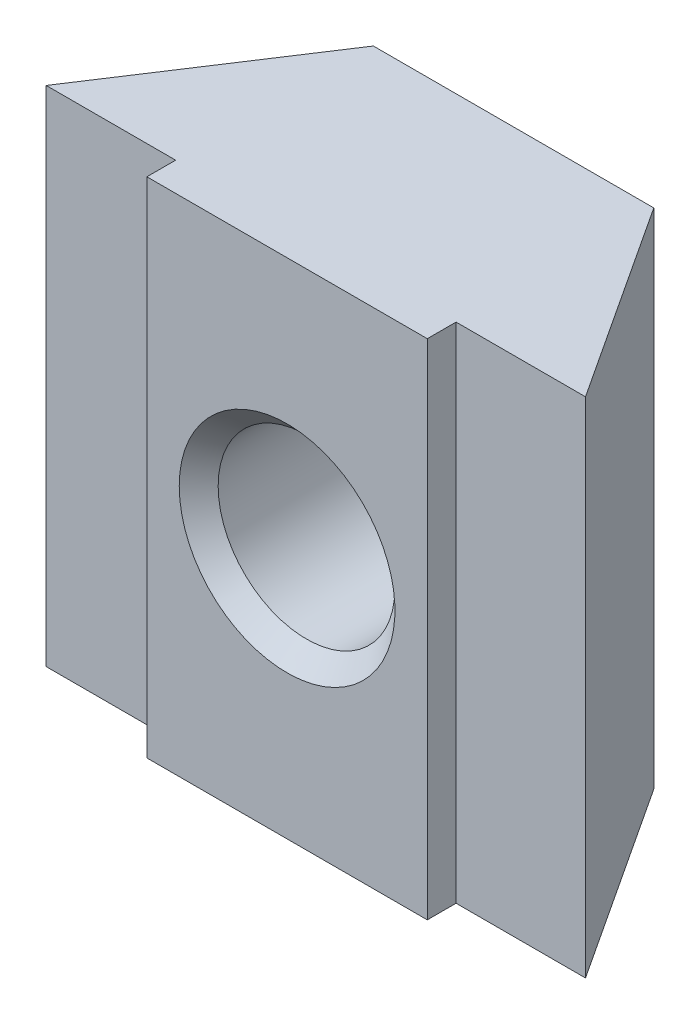
ISO-10303-21;
HEADER;
FILE_DESCRIPTION(('STEP AP214'),'2;1');
FILE_NAME('part.step','',(''),(''),'','','');
FILE_SCHEMA(('AUTOMOTIVE_DESIGN { 1 0 10303 214 1 1 1 1 }'));
ENDSEC;
DATA;
#1=APPLICATION_CONTEXT('core data for automotive mechanical design processes');
#2=APPLICATION_PROTOCOL_DEFINITION('international standard','automotive_design',2000,#1);
#3=PRODUCT_CONTEXT('',#1,'mechanical');
#4=PRODUCT('Part','Part','',(#3));
#5=PRODUCT_RELATED_PRODUCT_CATEGORY('part','',(#4));
#6=PRODUCT_DEFINITION_FORMATION('','',#4);
#7=PRODUCT_DEFINITION_CONTEXT('part definition',#1,'design');
#8=PRODUCT_DEFINITION('design','',#6,#7);
#9=PRODUCT_DEFINITION_SHAPE('','',#8);
#10=(LENGTH_UNIT() NAMED_UNIT(*) SI_UNIT(.MILLI.,.METRE.));
#11=(NAMED_UNIT(*) PLANE_ANGLE_UNIT() SI_UNIT($,.RADIAN.));
#12=(NAMED_UNIT(*) SI_UNIT($,.STERADIAN.) SOLID_ANGLE_UNIT());
#13=UNCERTAINTY_MEASURE_WITH_UNIT(LENGTH_MEASURE(1.E-05),#10,'distance_accuracy_value','');
#14=(GEOMETRIC_REPRESENTATION_CONTEXT(3) GLOBAL_UNCERTAINTY_ASSIGNED_CONTEXT((#13)) GLOBAL_UNIT_ASSIGNED_CONTEXT((#10,
#11,#12)) REPRESENTATION_CONTEXT('',''));
#15=CARTESIAN_POINT('',(0.,0.,0.));
#16=DIRECTION('',(0.,0.,1.));
#17=DIRECTION('',(1.,0.,0.));
#18=AXIS2_PLACEMENT_3D('',#15,#16,#17);
#19=CARTESIAN_POINT('',(8.,14.5,-10.1));
#20=DIRECTION('',(0.,0.,1.));
#21=DIRECTION('',(1.,0.,0.));
#22=AXIS2_PLACEMENT_3D('',#19,#20,#21);
#23=PLANE('',#22);
#24=DIRECTION('',(0.,1.,0.));
#25=VECTOR('',#24,1.);
#26=CARTESIAN_POINT('',(19.4,28.5,-10.1));
#27=LINE('',#26,#25);
#28=CARTESIAN_POINT('',(19.4,14.5,-10.1));
#29=VERTEX_POINT('',#28);
#30=CARTESIAN_POINT('',(19.4,28.5,-10.1));
#31=VERTEX_POINT('',#30);
#32=EDGE_CURVE('E50',#29,#31,#27,.T.);
#33=ORIENTED_EDGE('',*,*,#32,.F.);
#34=DIRECTION('',(1.,0.,0.));
#35=VECTOR('',#34,1.);
#36=CARTESIAN_POINT('',(8.,14.5,-10.1));
#37=LINE('',#36,#35);
#38=CARTESIAN_POINT('',(23.,14.5,-10.1));
#39=VERTEX_POINT('',#38);
#40=EDGE_CURVE('E149',#29,#39,#37,.T.);
#41=ORIENTED_EDGE('',*,*,#40,.T.);
#42=DIRECTION('',(0.,1.,0.));
#43=VECTOR('',#42,1.);
#44=CARTESIAN_POINT('',(23.,14.5,-10.1));
#45=LINE('',#44,#43);
#46=CARTESIAN_POINT('',(23.,28.5,-10.1));
#47=VERTEX_POINT('',#46);
#48=EDGE_CURVE('E190',#39,#47,#45,.T.);
#49=ORIENTED_EDGE('',*,*,#48,.T.);
#50=DIRECTION('',(1.,0.,0.));
#51=VECTOR('',#50,1.);
#52=CARTESIAN_POINT('',(8.,28.5,-10.1));
#53=LINE('',#52,#51);
#54=EDGE_CURVE('E55',#31,#47,#53,.T.);
#55=ORIENTED_EDGE('',*,*,#54,.F.);
#56=EDGE_LOOP('',(#33,#41,#49,#55));
#57=FACE_BOUND('',#56,.T.);
#58=ADVANCED_FACE('F35',(#57),#23,.T.);
#59=CARTESIAN_POINT('',(19.4,14.5,-15.6));
#60=DIRECTION('',(0.,0.,-1.));
#61=DIRECTION('',(-1.,0.,0.));
#62=AXIS2_PLACEMENT_3D('',#59,#60,#61);
#63=PLANE('',#62);
#64=CARTESIAN_POINT('',(15.5,21.5,-15.6));
#65=DIRECTION('',(0.,0.,-1.));
#66=DIRECTION('',(-1.,0.,0.));
#67=AXIS2_PLACEMENT_3D('',#64,#65,#66);
#68=CIRCLE('',#67,3.00000000000765);
#69=CARTESIAN_POINT('',(12.4999999999923,21.5,-15.6));
#70=VERTEX_POINT('',#69);
#71=EDGE_CURVE('E189',#70,#70,#68,.F.);
#72=ORIENTED_EDGE('',*,*,#71,.T.);
#73=EDGE_LOOP('',(#72));
#74=FACE_BOUND('',#73,.T.);
#75=DIRECTION('',(-1.,0.,0.));
#76=VECTOR('',#75,1.);
#77=CARTESIAN_POINT('',(19.4,28.5,-15.6));
#78=LINE('',#77,#76);
#79=CARTESIAN_POINT('',(19.4,28.5,-15.6));
#80=VERTEX_POINT('',#79);
#81=CARTESIAN_POINT('',(11.6,28.5,-15.6));
#82=VERTEX_POINT('',#81);
#83=EDGE_CURVE('E122',#80,#82,#78,.T.);
#84=ORIENTED_EDGE('',*,*,#83,.F.);
#85=DIRECTION('',(0.,1.,0.));
#86=VECTOR('',#85,1.);
#87=CARTESIAN_POINT('',(19.4,14.5,-15.6));
#88=LINE('',#87,#86);
#89=CARTESIAN_POINT('',(19.4,14.5,-15.6));
#90=VERTEX_POINT('',#89);
#91=EDGE_CURVE('E187',#90,#80,#88,.T.);
#92=ORIENTED_EDGE('',*,*,#91,.F.);
#93=DIRECTION('',(-1.,0.,0.));
#94=VECTOR('',#93,1.);
#95=CARTESIAN_POINT('',(19.4,14.5,-15.6));
#96=LINE('',#95,#94);
#97=CARTESIAN_POINT('',(11.6,14.5,-15.6));
#98=VERTEX_POINT('',#97);
#99=EDGE_CURVE('E143',#90,#98,#96,.T.);
#100=ORIENTED_EDGE('',*,*,#99,.T.);
#101=DIRECTION('',(0.,1.,0.));
#102=VECTOR('',#101,1.);
#103=CARTESIAN_POINT('',(11.6,14.5,-15.6));
#104=LINE('',#103,#102);
#105=EDGE_CURVE('E193',#98,#82,#104,.T.);
#106=ORIENTED_EDGE('',*,*,#105,.T.);
#107=EDGE_LOOP('',(#84,#92,#100,#106));
#108=FACE_BOUND('',#107,.T.);
#109=ADVANCED_FACE('F201',(#74,#108),#63,.T.);
#110=CARTESIAN_POINT('',(23.,14.5,-10.1));
#111=DIRECTION('',(0.836701516894204,0.,-0.547659174694388));
#112=DIRECTION('',(-0.547659174694388,0.,-0.836701516894204));
#113=AXIS2_PLACEMENT_3D('',#110,#111,#112);
#114=PLANE('',#113);
#115=DIRECTION('',(-0.547659174694388,0.,-0.836701516894204));
#116=VECTOR('',#115,1.);
#117=CARTESIAN_POINT('',(23.,28.5,-10.1));
#118=LINE('',#117,#116);
#119=EDGE_CURVE('E172',#47,#80,#118,.T.);
#120=ORIENTED_EDGE('',*,*,#119,.F.);
#121=ORIENTED_EDGE('',*,*,#48,.F.);
#122=DIRECTION('',(-0.547659174694388,0.,-0.836701516894204));
#123=VECTOR('',#122,1.);
#124=CARTESIAN_POINT('',(23.,14.5,-10.1));
#125=LINE('',#124,#123);
#126=EDGE_CURVE('E164',#39,#90,#125,.T.);
#127=ORIENTED_EDGE('',*,*,#126,.T.);
#128=ORIENTED_EDGE('',*,*,#91,.T.);
#129=EDGE_LOOP('',(#120,#121,#127,#128));
#130=FACE_BOUND('',#129,.T.);
#131=ADVANCED_FACE('F199',(#130),#114,.T.);
#132=DIRECTION('',(0.,-1.,0.));
#133=VECTOR('',#132,1.);
#134=CARTESIAN_POINT('',(11.6,14.5,-10.1));
#135=LINE('',#134,#133);
#136=CARTESIAN_POINT('',(11.6,28.5,-10.1));
#137=VERTEX_POINT('',#136);
#138=CARTESIAN_POINT('',(11.6,14.5,-10.1));
#139=VERTEX_POINT('',#138);
#140=EDGE_CURVE('E119',#137,#139,#135,.T.);
#141=ORIENTED_EDGE('',*,*,#140,.F.);
#142=CARTESIAN_POINT('',(8.,28.5,-10.1));
#143=VERTEX_POINT('',#142);
#144=EDGE_CURVE('E179',#143,#137,#53,.T.);
#145=ORIENTED_EDGE('',*,*,#144,.F.);
#146=DIRECTION('',(0.,1.,0.));
#147=VECTOR('',#146,1.);
#148=CARTESIAN_POINT('',(8.,14.5,-10.1));
#149=LINE('',#148,#147);
#150=CARTESIAN_POINT('',(8.,14.5,-10.1));
#151=VERTEX_POINT('',#150);
#152=EDGE_CURVE('E192',#151,#143,#149,.T.);
#153=ORIENTED_EDGE('',*,*,#152,.F.);
#154=EDGE_CURVE('E166',#151,#139,#37,.T.);
#155=ORIENTED_EDGE('',*,*,#154,.T.);
#156=EDGE_LOOP('',(#141,#145,#153,#155));
#157=FACE_BOUND('',#156,.T.);
#158=ADVANCED_FACE('F203',(#157),#23,.T.);
#159=CARTESIAN_POINT('',(11.6,14.5,-15.6));
#160=DIRECTION('',(-0.836701516894204,0.,-0.547659174694388));
#161=DIRECTION('',(-0.547659174694388,0.,0.836701516894204));
#162=AXIS2_PLACEMENT_3D('',#159,#160,#161);
#163=PLANE('',#162);
#164=DIRECTION('',(-0.547659174694388,0.,0.836701516894204));
#165=VECTOR('',#164,1.);
#166=CARTESIAN_POINT('',(11.6,28.5,-15.6));
#167=LINE('',#166,#165);
#168=EDGE_CURVE('E124',#82,#143,#167,.T.);
#169=ORIENTED_EDGE('',*,*,#168,.F.);
#170=ORIENTED_EDGE('',*,*,#105,.F.);
#171=DIRECTION('',(-0.547659174694388,0.,0.836701516894204));
#172=VECTOR('',#171,1.);
#173=CARTESIAN_POINT('',(11.6,14.5,-15.6));
#174=LINE('',#173,#172);
#175=EDGE_CURVE('E167',#98,#151,#174,.T.);
#176=ORIENTED_EDGE('',*,*,#175,.T.);
#177=ORIENTED_EDGE('',*,*,#152,.T.);
#178=EDGE_LOOP('',(#169,#170,#176,#177));
#179=FACE_BOUND('',#178,.T.);
#180=ADVANCED_FACE('F212',(#179),#163,.T.);
#181=CARTESIAN_POINT('',(0.,14.5,0.));
#182=DIRECTION('',(0.,1.,0.));
#183=DIRECTION('',(0.,0.,1.));
#184=AXIS2_PLACEMENT_3D('',#181,#182,#183);
#185=PLANE('',#184);
#186=ORIENTED_EDGE('',*,*,#99,.F.);
#187=ORIENTED_EDGE('',*,*,#126,.F.);
#188=ORIENTED_EDGE('',*,*,#40,.F.);
#189=DIRECTION('',(0.,0.,-1.));
#190=VECTOR('',#189,1.);
#191=CARTESIAN_POINT('',(19.4,14.5,-9.3));
#192=LINE('',#191,#190);
#193=CARTESIAN_POINT('',(19.4,14.5,-9.3));
#194=VERTEX_POINT('',#193);
#195=EDGE_CURVE('E135',#194,#29,#192,.T.);
#196=ORIENTED_EDGE('',*,*,#195,.F.);
#197=DIRECTION('',(1.,0.,0.));
#198=VECTOR('',#197,1.);
#199=CARTESIAN_POINT('',(19.4,14.5,-9.3));
#200=LINE('',#199,#198);
#201=CARTESIAN_POINT('',(11.6,14.5,-9.3));
#202=VERTEX_POINT('',#201);
#203=EDGE_CURVE('E115',#202,#194,#200,.T.);
#204=ORIENTED_EDGE('',*,*,#203,.F.);
#205=DIRECTION('',(0.,0.,-1.));
#206=VECTOR('',#205,1.);
#207=CARTESIAN_POINT('',(11.6,14.5,-9.3));
#208=LINE('',#207,#206);
#209=EDGE_CURVE('E126',#202,#139,#208,.T.);
#210=ORIENTED_EDGE('',*,*,#209,.T.);
#211=ORIENTED_EDGE('',*,*,#154,.F.);
#212=ORIENTED_EDGE('',*,*,#175,.F.);
#213=EDGE_LOOP('',(#186,#187,#188,#196,#204,#210,#211,#212));
#214=FACE_BOUND('',#213,.T.);
#215=ADVANCED_FACE('F161',(#214),#185,.F.);
#216=CARTESIAN_POINT('',(0.,28.5,0.));
#217=DIRECTION('',(0.,1.,0.));
#218=DIRECTION('',(0.,0.,1.));
#219=AXIS2_PLACEMENT_3D('',#216,#217,#218);
#220=PLANE('',#219);
#221=ORIENTED_EDGE('',*,*,#83,.T.);
#222=ORIENTED_EDGE('',*,*,#168,.T.);
#223=ORIENTED_EDGE('',*,*,#144,.T.);
#224=DIRECTION('',(0.,0.,-1.));
#225=VECTOR('',#224,1.);
#226=CARTESIAN_POINT('',(11.6,28.5,-9.3));
#227=LINE('',#226,#225);
#228=CARTESIAN_POINT('',(11.6,28.5,-9.3));
#229=VERTEX_POINT('',#228);
#230=EDGE_CURVE('E106',#229,#137,#227,.T.);
#231=ORIENTED_EDGE('',*,*,#230,.F.);
#232=DIRECTION('',(-1.,0.,0.));
#233=VECTOR('',#232,1.);
#234=CARTESIAN_POINT('',(11.6,28.5,-9.3));
#235=LINE('',#234,#233);
#236=CARTESIAN_POINT('',(19.4,28.5,-9.3));
#237=VERTEX_POINT('',#236);
#238=EDGE_CURVE('E98',#237,#229,#235,.T.);
#239=ORIENTED_EDGE('',*,*,#238,.F.);
#240=DIRECTION('',(0.,0.,-1.));
#241=VECTOR('',#240,1.);
#242=CARTESIAN_POINT('',(19.4,28.5,-9.3));
#243=LINE('',#242,#241);
#244=EDGE_CURVE('E103',#237,#31,#243,.T.);
#245=ORIENTED_EDGE('',*,*,#244,.T.);
#246=ORIENTED_EDGE('',*,*,#54,.T.);
#247=ORIENTED_EDGE('',*,*,#119,.T.);
#248=EDGE_LOOP('',(#221,#222,#223,#231,#239,#245,#246,#247));
#249=FACE_BOUND('',#248,.T.);
#250=ADVANCED_FACE('F101',(#249),#220,.T.);
#251=CARTESIAN_POINT('',(19.4,28.5,-9.3));
#252=DIRECTION('',(-1.,0.,0.));
#253=DIRECTION('',(0.,0.,1.));
#254=AXIS2_PLACEMENT_3D('',#251,#252,#253);
#255=PLANE('',#254);
#256=ORIENTED_EDGE('',*,*,#32,.T.);
#257=ORIENTED_EDGE('',*,*,#244,.F.);
#258=DIRECTION('',(0.,1.,0.));
#259=VECTOR('',#258,1.);
#260=CARTESIAN_POINT('',(19.4,28.5,-9.3));
#261=LINE('',#260,#259);
#262=EDGE_CURVE('E110',#194,#237,#261,.T.);
#263=ORIENTED_EDGE('',*,*,#262,.F.);
#264=ORIENTED_EDGE('',*,*,#195,.T.);
#265=EDGE_LOOP('',(#256,#257,#263,#264));
#266=FACE_BOUND('',#265,.T.);
#267=ADVANCED_FACE('F121',(#266),#255,.F.);
#268=CARTESIAN_POINT('',(11.6,14.5,-9.3));
#269=DIRECTION('',(1.,0.,0.));
#270=DIRECTION('',(0.,0.,-1.));
#271=AXIS2_PLACEMENT_3D('',#268,#269,#270);
#272=PLANE('',#271);
#273=ORIENTED_EDGE('',*,*,#140,.T.);
#274=ORIENTED_EDGE('',*,*,#209,.F.);
#275=DIRECTION('',(0.,-1.,0.));
#276=VECTOR('',#275,1.);
#277=CARTESIAN_POINT('',(11.6,14.5,-9.3));
#278=LINE('',#277,#276);
#279=EDGE_CURVE('E109',#229,#202,#278,.T.);
#280=ORIENTED_EDGE('',*,*,#279,.F.);
#281=ORIENTED_EDGE('',*,*,#230,.T.);
#282=EDGE_LOOP('',(#273,#274,#280,#281));
#283=FACE_BOUND('',#282,.T.);
#284=ADVANCED_FACE('F159',(#283),#272,.F.);
#285=CARTESIAN_POINT('',(0.,0.,-9.3));
#286=DIRECTION('',(0.,0.,-1.));
#287=DIRECTION('',(-1.,0.,0.));
#288=AXIS2_PLACEMENT_3D('',#285,#286,#287);
#289=PLANE('',#288);
#290=CARTESIAN_POINT('',(15.5,21.5,-9.3));
#291=DIRECTION('',(0.,0.,-1.));
#292=DIRECTION('',(-1.,0.,0.));
#293=AXIS2_PLACEMENT_3D('',#290,#291,#292);
#294=CIRCLE('',#293,3.00000000000765);
#295=CARTESIAN_POINT('',(12.4999999999924,21.5,-9.3));
#296=VERTEX_POINT('',#295);
#297=EDGE_CURVE('E11',#296,#296,#294,.T.);
#298=ORIENTED_EDGE('',*,*,#297,.T.);
#299=EDGE_LOOP('',(#298));
#300=FACE_BOUND('',#299,.T.);
#301=ORIENTED_EDGE('',*,*,#262,.T.);
#302=ORIENTED_EDGE('',*,*,#238,.T.);
#303=ORIENTED_EDGE('',*,*,#279,.T.);
#304=ORIENTED_EDGE('',*,*,#203,.T.);
#305=EDGE_LOOP('',(#301,#302,#303,#304));
#306=FACE_BOUND('',#305,.T.);
#307=ADVANCED_FACE('F113',(#300,#306),#289,.F.);
#308=CARTESIAN_POINT('',(15.5,21.5,-9.3));
#309=DIRECTION('',(0.,0.,1.));
#310=DIRECTION('',(1.,0.,0.));
#311=AXIS2_PLACEMENT_3D('',#308,#309,#310);
#312=CYLINDRICAL_SURFACE('',#311,2.45850000000001);
#313=CARTESIAN_POINT('',(15.5,21.5,-15.0584999999924));
#314=DIRECTION('',(0.,0.,-1.));
#315=DIRECTION('',(-1.,0.,0.));
#316=AXIS2_PLACEMENT_3D('',#313,#314,#315);
#317=CIRCLE('',#316,2.45850000000001);
#318=CARTESIAN_POINT('',(13.0415,21.5,-15.0584999999924));
#319=VERTEX_POINT('',#318);
#320=EDGE_CURVE('E43',#319,#319,#317,.T.);
#321=ORIENTED_EDGE('',*,*,#320,.T.);
#322=EDGE_LOOP('',(#321));
#323=FACE_BOUND('',#322,.T.);
#324=CARTESIAN_POINT('',(15.5,21.5,-9.84150000000764));
#325=DIRECTION('',(0.,0.,-1.));
#326=DIRECTION('',(-1.,0.,0.));
#327=AXIS2_PLACEMENT_3D('',#324,#325,#326);
#328=CIRCLE('',#327,2.45850000000001);
#329=CARTESIAN_POINT('',(13.0415,21.5,-9.84150000000764));
#330=VERTEX_POINT('',#329);
#331=EDGE_CURVE('E247',#330,#330,#328,.F.);
#332=ORIENTED_EDGE('',*,*,#331,.T.);
#333=EDGE_LOOP('',(#332));
#334=FACE_BOUND('',#333,.T.);
#335=ADVANCED_FACE('F233',(#323,#334),#312,.F.);
#336=CARTESIAN_POINT('',(15.5,21.5,-15.6));
#337=DIRECTION('',(0.,0.,-1.));
#338=DIRECTION('',(-1.,0.,0.));
#339=AXIS2_PLACEMENT_3D('',#336,#337,#338);
#340=CONICAL_SURFACE('',#339,3.00000000000765,0.785398163397448);
#341=ORIENTED_EDGE('',*,*,#320,.F.);
#342=EDGE_LOOP('',(#341));
#343=FACE_BOUND('',#342,.T.);
#344=ORIENTED_EDGE('',*,*,#71,.F.);
#345=EDGE_LOOP('',(#344));
#346=FACE_BOUND('',#345,.T.);
#347=ADVANCED_FACE('F236',(#343,#346),#340,.F.);
#348=CARTESIAN_POINT('',(15.5,21.5,-9.84150000000764));
#349=DIRECTION('',(0.,0.,1.));
#350=DIRECTION('',(1.,0.,0.));
#351=AXIS2_PLACEMENT_3D('',#348,#349,#350);
#352=CONICAL_SURFACE('',#351,2.45850000000001,0.78539816339745);
#353=ORIENTED_EDGE('',*,*,#297,.F.);
#354=EDGE_LOOP('',(#353));
#355=FACE_BOUND('',#354,.T.);
#356=ORIENTED_EDGE('',*,*,#331,.F.);
#357=EDGE_LOOP('',(#356));
#358=FACE_BOUND('',#357,.T.);
#359=ADVANCED_FACE('F37',(#355,#358),#352,.F.);
#360=CLOSED_SHELL('',(#58,#109,#131,#158,#180,#215,#250,#267,#284,#307,#335,#347,#359));
#361=MANIFOLD_SOLID_BREP('B2',#360);
#362=ADVANCED_BREP_SHAPE_REPRESENTATION('',(#18,#361),#14);
#363=SHAPE_DEFINITION_REPRESENTATION(#9,#362);
ENDSEC;
END-ISO-10303-21;
